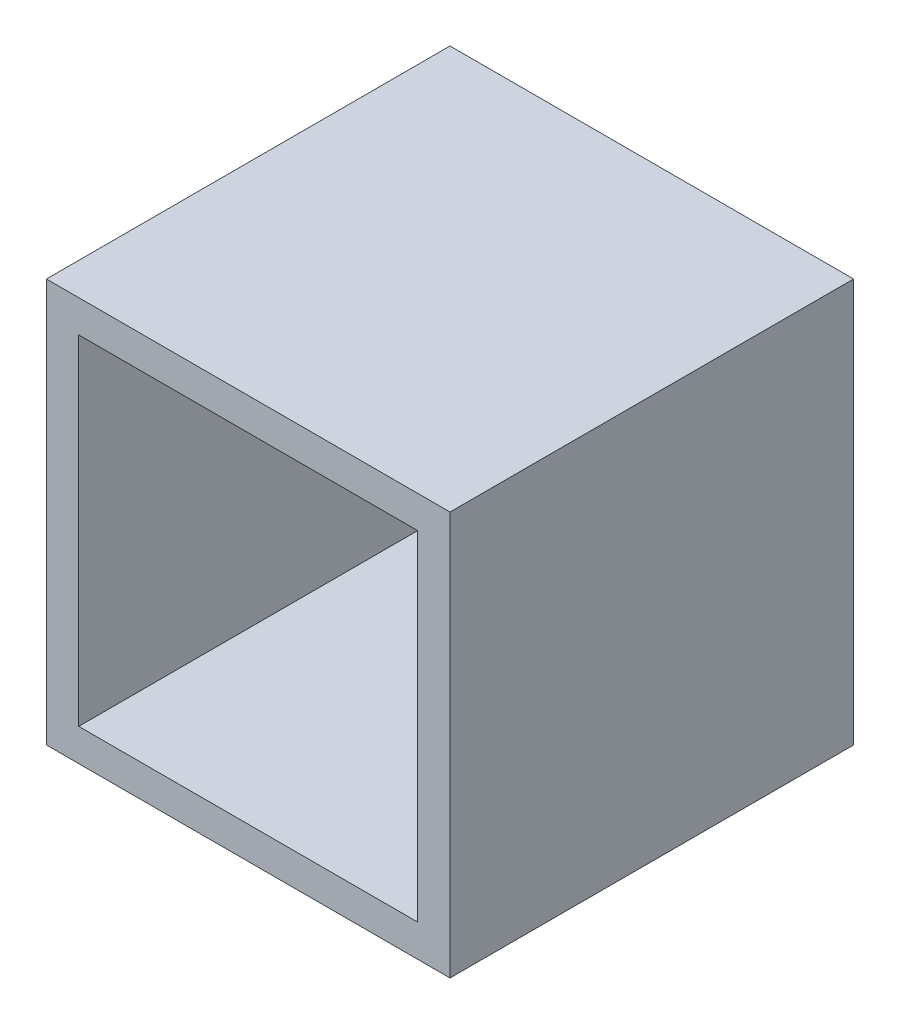
ISO-10303-21;
HEADER;
FILE_DESCRIPTION(('STEP AP214'),'2;1');
FILE_NAME('part.step','',(''),(''),'','','');
FILE_SCHEMA(('AUTOMOTIVE_DESIGN { 1 0 10303 214 1 1 1 1 }'));
ENDSEC;
DATA;
#1=APPLICATION_CONTEXT('core data for automotive mechanical design processes');
#2=APPLICATION_PROTOCOL_DEFINITION('international standard','automotive_design',2000,#1);
#3=PRODUCT_CONTEXT('',#1,'mechanical');
#4=PRODUCT('Part','Part','',(#3));
#5=PRODUCT_RELATED_PRODUCT_CATEGORY('part','',(#4));
#6=PRODUCT_DEFINITION_FORMATION('','',#4);
#7=PRODUCT_DEFINITION_CONTEXT('part definition',#1,'design');
#8=PRODUCT_DEFINITION('design','',#6,#7);
#9=PRODUCT_DEFINITION_SHAPE('','',#8);
#10=(LENGTH_UNIT() NAMED_UNIT(*) SI_UNIT(.MILLI.,.METRE.));
#11=(NAMED_UNIT(*) PLANE_ANGLE_UNIT() SI_UNIT($,.RADIAN.));
#12=(NAMED_UNIT(*) SI_UNIT($,.STERADIAN.) SOLID_ANGLE_UNIT());
#13=UNCERTAINTY_MEASURE_WITH_UNIT(LENGTH_MEASURE(1.E-05),#10,'distance_accuracy_value','');
#14=(GEOMETRIC_REPRESENTATION_CONTEXT(3) GLOBAL_UNCERTAINTY_ASSIGNED_CONTEXT((#13)) GLOBAL_UNIT_ASSIGNED_CONTEXT((#10,
#11,#12)) REPRESENTATION_CONTEXT('',''));
#15=CARTESIAN_POINT('',(0.,0.,0.));
#16=DIRECTION('',(0.,0.,1.));
#17=DIRECTION('',(1.,0.,0.));
#18=AXIS2_PLACEMENT_3D('',#15,#16,#17);
#19=CARTESIAN_POINT('',(-5.,5.,0.8));
#20=DIRECTION('',(1.,0.,0.));
#21=DIRECTION('',(0.,0.,-1.));
#22=AXIS2_PLACEMENT_3D('',#19,#20,#21);
#23=PLANE('',#22);
#24=DIRECTION('',(0.,-1.,0.));
#25=VECTOR('',#24,1.);
#26=CARTESIAN_POINT('',(-5.,5.,0.));
#27=LINE('',#26,#25);
#28=CARTESIAN_POINT('',(-5.,5.,0.));
#29=VERTEX_POINT('',#28);
#30=CARTESIAN_POINT('',(-5.,-5.,0.));
#31=VERTEX_POINT('',#30);
#32=EDGE_CURVE('E144',#29,#31,#27,.T.);
#33=ORIENTED_EDGE('',*,*,#32,.T.);
#34=DIRECTION('',(0.,0.,-1.));
#35=VECTOR('',#34,1.);
#36=CARTESIAN_POINT('',(-5.,-5.,0.8));
#37=LINE('',#36,#35);
#38=CARTESIAN_POINT('',(-5.,-5.,10.));
#39=VERTEX_POINT('',#38);
#40=EDGE_CURVE('E11',#39,#31,#37,.T.);
#41=ORIENTED_EDGE('',*,*,#40,.F.);
#42=DIRECTION('',(0.,-1.,0.));
#43=VECTOR('',#42,1.);
#44=CARTESIAN_POINT('',(-5.,5.,10.));
#45=LINE('',#44,#43);
#46=CARTESIAN_POINT('',(-5.,5.,10.));
#47=VERTEX_POINT('',#46);
#48=EDGE_CURVE('E111',#47,#39,#45,.T.);
#49=ORIENTED_EDGE('',*,*,#48,.F.);
#50=DIRECTION('',(0.,0.,-1.));
#51=VECTOR('',#50,1.);
#52=CARTESIAN_POINT('',(-5.,5.,0.8));
#53=LINE('',#52,#51);
#54=EDGE_CURVE('E153',#47,#29,#53,.T.);
#55=ORIENTED_EDGE('',*,*,#54,.T.);
#56=EDGE_LOOP('',(#33,#41,#49,#55));
#57=FACE_BOUND('',#56,.T.);
#58=ADVANCED_FACE('F33',(#57),#23,.F.);
#59=CARTESIAN_POINT('',(-5.,-5.,0.8));
#60=DIRECTION('',(0.,1.,0.));
#61=DIRECTION('',(-1.,0.,0.));
#62=AXIS2_PLACEMENT_3D('',#59,#60,#61);
#63=PLANE('',#62);
#64=DIRECTION('',(1.,0.,0.));
#65=VECTOR('',#64,1.);
#66=CARTESIAN_POINT('',(-5.,-5.,0.));
#67=LINE('',#66,#65);
#68=CARTESIAN_POINT('',(5.,-5.,0.));
#69=VERTEX_POINT('',#68);
#70=EDGE_CURVE('E147',#31,#69,#67,.T.);
#71=ORIENTED_EDGE('',*,*,#70,.T.);
#72=DIRECTION('',(0.,0.,-1.));
#73=VECTOR('',#72,1.);
#74=CARTESIAN_POINT('',(5.,-5.,0.8));
#75=LINE('',#74,#73);
#76=CARTESIAN_POINT('',(5.,-5.,10.));
#77=VERTEX_POINT('',#76);
#78=EDGE_CURVE('E40',#77,#69,#75,.T.);
#79=ORIENTED_EDGE('',*,*,#78,.F.);
#80=DIRECTION('',(1.,0.,0.));
#81=VECTOR('',#80,1.);
#82=CARTESIAN_POINT('',(-5.,-5.,10.));
#83=LINE('',#82,#81);
#84=EDGE_CURVE('E135',#39,#77,#83,.T.);
#85=ORIENTED_EDGE('',*,*,#84,.F.);
#86=ORIENTED_EDGE('',*,*,#40,.T.);
#87=EDGE_LOOP('',(#71,#79,#85,#86));
#88=FACE_BOUND('',#87,.T.);
#89=ADVANCED_FACE('F175',(#88),#63,.F.);
#90=CARTESIAN_POINT('',(5.,5.,0.8));
#91=DIRECTION('',(-1.,0.,0.));
#92=DIRECTION('',(0.,0.,1.));
#93=AXIS2_PLACEMENT_3D('',#90,#91,#92);
#94=PLANE('',#93);
#95=DIRECTION('',(0.,1.,0.));
#96=VECTOR('',#95,1.);
#97=CARTESIAN_POINT('',(5.,5.,0.));
#98=LINE('',#97,#96);
#99=CARTESIAN_POINT('',(5.,5.,0.));
#100=VERTEX_POINT('',#99);
#101=EDGE_CURVE('E149',#69,#100,#98,.T.);
#102=ORIENTED_EDGE('',*,*,#101,.T.);
#103=DIRECTION('',(0.,0.,-1.));
#104=VECTOR('',#103,1.);
#105=CARTESIAN_POINT('',(5.,5.,0.8));
#106=LINE('',#105,#104);
#107=CARTESIAN_POINT('',(5.,5.,10.));
#108=VERTEX_POINT('',#107);
#109=EDGE_CURVE('E156',#108,#100,#106,.T.);
#110=ORIENTED_EDGE('',*,*,#109,.F.);
#111=DIRECTION('',(0.,1.,0.));
#112=VECTOR('',#111,1.);
#113=CARTESIAN_POINT('',(5.,5.,10.));
#114=LINE('',#113,#112);
#115=EDGE_CURVE('E138',#77,#108,#114,.T.);
#116=ORIENTED_EDGE('',*,*,#115,.F.);
#117=ORIENTED_EDGE('',*,*,#78,.T.);
#118=EDGE_LOOP('',(#102,#110,#116,#117));
#119=FACE_BOUND('',#118,.T.);
#120=ADVANCED_FACE('F162',(#119),#94,.F.);
#121=CARTESIAN_POINT('',(-5.,5.,0.8));
#122=DIRECTION('',(0.,-1.,0.));
#123=DIRECTION('',(1.,0.,0.));
#124=AXIS2_PLACEMENT_3D('',#121,#122,#123);
#125=PLANE('',#124);
#126=DIRECTION('',(-1.,0.,0.));
#127=VECTOR('',#126,1.);
#128=CARTESIAN_POINT('',(-5.,5.,0.));
#129=LINE('',#128,#127);
#130=EDGE_CURVE('E151',#100,#29,#129,.T.);
#131=ORIENTED_EDGE('',*,*,#130,.T.);
#132=ORIENTED_EDGE('',*,*,#54,.F.);
#133=DIRECTION('',(-1.,0.,0.));
#134=VECTOR('',#133,1.);
#135=CARTESIAN_POINT('',(-5.,5.,10.));
#136=LINE('',#135,#134);
#137=EDGE_CURVE('E141',#108,#47,#136,.T.);
#138=ORIENTED_EDGE('',*,*,#137,.F.);
#139=ORIENTED_EDGE('',*,*,#109,.T.);
#140=EDGE_LOOP('',(#131,#132,#138,#139));
#141=FACE_BOUND('',#140,.T.);
#142=ADVANCED_FACE('F170',(#141),#125,.F.);
#143=CARTESIAN_POINT('',(0.,0.,0.));
#144=DIRECTION('',(0.,0.,1.));
#145=DIRECTION('',(1.,0.,0.));
#146=AXIS2_PLACEMENT_3D('',#143,#144,#145);
#147=PLANE('',#146);
#148=ORIENTED_EDGE('',*,*,#32,.F.);
#149=ORIENTED_EDGE('',*,*,#130,.F.);
#150=ORIENTED_EDGE('',*,*,#101,.F.);
#151=ORIENTED_EDGE('',*,*,#70,.F.);
#152=EDGE_LOOP('',(#148,#149,#150,#151));
#153=FACE_BOUND('',#152,.T.);
#154=ADVANCED_FACE('F168',(#153),#147,.F.);
#155=CARTESIAN_POINT('',(0.,0.,10.));
#156=DIRECTION('',(0.,0.,1.));
#157=DIRECTION('',(1.,0.,0.));
#158=AXIS2_PLACEMENT_3D('',#155,#156,#157);
#159=PLANE('',#158);
#160=ORIENTED_EDGE('',*,*,#48,.T.);
#161=ORIENTED_EDGE('',*,*,#84,.T.);
#162=ORIENTED_EDGE('',*,*,#115,.T.);
#163=ORIENTED_EDGE('',*,*,#137,.T.);
#164=EDGE_LOOP('',(#160,#161,#162,#163));
#165=FACE_BOUND('',#164,.T.);
#166=DIRECTION('',(1.,0.,0.));
#167=VECTOR('',#166,1.);
#168=CARTESIAN_POINT('',(-4.2,-4.2,10.));
#169=LINE('',#168,#167);
#170=CARTESIAN_POINT('',(-4.2,-4.2,10.));
#171=VERTEX_POINT('',#170);
#172=CARTESIAN_POINT('',(4.2,-4.2,10.));
#173=VERTEX_POINT('',#172);
#174=EDGE_CURVE('E105',#171,#173,#169,.T.);
#175=ORIENTED_EDGE('',*,*,#174,.F.);
#176=DIRECTION('',(0.,-1.,0.));
#177=VECTOR('',#176,1.);
#178=CARTESIAN_POINT('',(-4.2,4.2,10.));
#179=LINE('',#178,#177);
#180=CARTESIAN_POINT('',(-4.2,4.2,10.));
#181=VERTEX_POINT('',#180);
#182=EDGE_CURVE('E96',#181,#171,#179,.T.);
#183=ORIENTED_EDGE('',*,*,#182,.F.);
#184=DIRECTION('',(-1.,0.,0.));
#185=VECTOR('',#184,1.);
#186=CARTESIAN_POINT('',(-4.2,4.2,10.));
#187=LINE('',#186,#185);
#188=CARTESIAN_POINT('',(4.2,4.2,10.));
#189=VERTEX_POINT('',#188);
#190=EDGE_CURVE('E119',#189,#181,#187,.T.);
#191=ORIENTED_EDGE('',*,*,#190,.F.);
#192=DIRECTION('',(0.,1.,0.));
#193=VECTOR('',#192,1.);
#194=CARTESIAN_POINT('',(4.2,4.2,10.));
#195=LINE('',#194,#193);
#196=EDGE_CURVE('E117',#173,#189,#195,.T.);
#197=ORIENTED_EDGE('',*,*,#196,.F.);
#198=EDGE_LOOP('',(#175,#183,#191,#197));
#199=FACE_BOUND('',#198,.T.);
#200=ADVANCED_FACE('F115',(#165,#199),#159,.T.);
#201=CARTESIAN_POINT('',(-4.2,4.2,10.));
#202=DIRECTION('',(1.,0.,0.));
#203=DIRECTION('',(0.,1.,0.));
#204=AXIS2_PLACEMENT_3D('',#201,#202,#203);
#205=PLANE('',#204);
#206=DIRECTION('',(0.,-1.,0.));
#207=VECTOR('',#206,1.);
#208=CARTESIAN_POINT('',(-4.2,4.2,0.8));
#209=LINE('',#208,#207);
#210=CARTESIAN_POINT('',(-4.2,4.2,0.8));
#211=VERTEX_POINT('',#210);
#212=CARTESIAN_POINT('',(-4.2,-4.2,0.8));
#213=VERTEX_POINT('',#212);
#214=EDGE_CURVE('E47',#211,#213,#209,.T.);
#215=ORIENTED_EDGE('',*,*,#214,.F.);
#216=DIRECTION('',(0.,0.,-1.));
#217=VECTOR('',#216,1.);
#218=CARTESIAN_POINT('',(-4.2,4.2,10.));
#219=LINE('',#218,#217);
#220=EDGE_CURVE('E101',#181,#211,#219,.T.);
#221=ORIENTED_EDGE('',*,*,#220,.F.);
#222=ORIENTED_EDGE('',*,*,#182,.T.);
#223=DIRECTION('',(0.,0.,-1.));
#224=VECTOR('',#223,1.);
#225=CARTESIAN_POINT('',(-4.2,-4.2,10.));
#226=LINE('',#225,#224);
#227=EDGE_CURVE('E99',#171,#213,#226,.T.);
#228=ORIENTED_EDGE('',*,*,#227,.T.);
#229=EDGE_LOOP('',(#215,#221,#222,#228));
#230=FACE_BOUND('',#229,.T.);
#231=ADVANCED_FACE('F98',(#230),#205,.T.);
#232=CARTESIAN_POINT('',(-4.2,-4.2,10.));
#233=DIRECTION('',(0.,1.,0.));
#234=DIRECTION('',(0.,0.,1.));
#235=AXIS2_PLACEMENT_3D('',#232,#233,#234);
#236=PLANE('',#235);
#237=DIRECTION('',(1.,0.,0.));
#238=VECTOR('',#237,1.);
#239=CARTESIAN_POINT('',(-4.2,-4.2,0.8));
#240=LINE('',#239,#238);
#241=CARTESIAN_POINT('',(4.2,-4.2,0.8));
#242=VERTEX_POINT('',#241);
#243=EDGE_CURVE('E51',#213,#242,#240,.T.);
#244=ORIENTED_EDGE('',*,*,#243,.F.);
#245=ORIENTED_EDGE('',*,*,#227,.F.);
#246=ORIENTED_EDGE('',*,*,#174,.T.);
#247=DIRECTION('',(0.,0.,-1.));
#248=VECTOR('',#247,1.);
#249=CARTESIAN_POINT('',(4.2,-4.2,10.));
#250=LINE('',#249,#248);
#251=EDGE_CURVE('E112',#173,#242,#250,.T.);
#252=ORIENTED_EDGE('',*,*,#251,.T.);
#253=EDGE_LOOP('',(#244,#245,#246,#252));
#254=FACE_BOUND('',#253,.T.);
#255=ADVANCED_FACE('F109',(#254),#236,.T.);
#256=CARTESIAN_POINT('',(4.2,4.2,10.));
#257=DIRECTION('',(-1.,0.,0.));
#258=DIRECTION('',(0.,-1.,0.));
#259=AXIS2_PLACEMENT_3D('',#256,#257,#258);
#260=PLANE('',#259);
#261=DIRECTION('',(0.,1.,0.));
#262=VECTOR('',#261,1.);
#263=CARTESIAN_POINT('',(4.2,4.2,0.8));
#264=LINE('',#263,#262);
#265=CARTESIAN_POINT('',(4.2,4.2,0.8));
#266=VERTEX_POINT('',#265);
#267=EDGE_CURVE('E125',#242,#266,#264,.T.);
#268=ORIENTED_EDGE('',*,*,#267,.F.);
#269=ORIENTED_EDGE('',*,*,#251,.F.);
#270=ORIENTED_EDGE('',*,*,#196,.T.);
#271=DIRECTION('',(0.,0.,-1.));
#272=VECTOR('',#271,1.);
#273=CARTESIAN_POINT('',(4.2,4.2,10.));
#274=LINE('',#273,#272);
#275=EDGE_CURVE('E129',#189,#266,#274,.T.);
#276=ORIENTED_EDGE('',*,*,#275,.T.);
#277=EDGE_LOOP('',(#268,#269,#270,#276));
#278=FACE_BOUND('',#277,.T.);
#279=ADVANCED_FACE('F197',(#278),#260,.T.);
#280=CARTESIAN_POINT('',(-4.2,4.2,10.));
#281=DIRECTION('',(0.,-1.,0.));
#282=DIRECTION('',(0.,0.,-1.));
#283=AXIS2_PLACEMENT_3D('',#280,#281,#282);
#284=PLANE('',#283);
#285=DIRECTION('',(-1.,0.,0.));
#286=VECTOR('',#285,1.);
#287=CARTESIAN_POINT('',(-4.2,4.2,0.8));
#288=LINE('',#287,#286);
#289=EDGE_CURVE('E106',#266,#211,#288,.T.);
#290=ORIENTED_EDGE('',*,*,#289,.F.);
#291=ORIENTED_EDGE('',*,*,#275,.F.);
#292=ORIENTED_EDGE('',*,*,#190,.T.);
#293=ORIENTED_EDGE('',*,*,#220,.T.);
#294=EDGE_LOOP('',(#290,#291,#292,#293));
#295=FACE_BOUND('',#294,.T.);
#296=ADVANCED_FACE('F190',(#295),#284,.T.);
#297=CARTESIAN_POINT('',(0.,0.,0.8));
#298=DIRECTION('',(0.,0.,1.));
#299=DIRECTION('',(1.,0.,0.));
#300=AXIS2_PLACEMENT_3D('',#297,#298,#299);
#301=PLANE('',#300);
#302=ORIENTED_EDGE('',*,*,#214,.T.);
#303=ORIENTED_EDGE('',*,*,#243,.T.);
#304=ORIENTED_EDGE('',*,*,#267,.T.);
#305=ORIENTED_EDGE('',*,*,#289,.T.);
#306=EDGE_LOOP('',(#302,#303,#304,#305));
#307=FACE_BOUND('',#306,.T.);
#308=ADVANCED_FACE('F187',(#307),#301,.T.);
#309=CLOSED_SHELL('',(#58,#89,#120,#142,#154,#200,#231,#255,#279,#296,#308));
#310=MANIFOLD_SOLID_BREP('B2',#309);
#311=ADVANCED_BREP_SHAPE_REPRESENTATION('',(#18,#310),#14);
#312=SHAPE_DEFINITION_REPRESENTATION(#9,#311);
ENDSEC;
END-ISO-10303-21;
